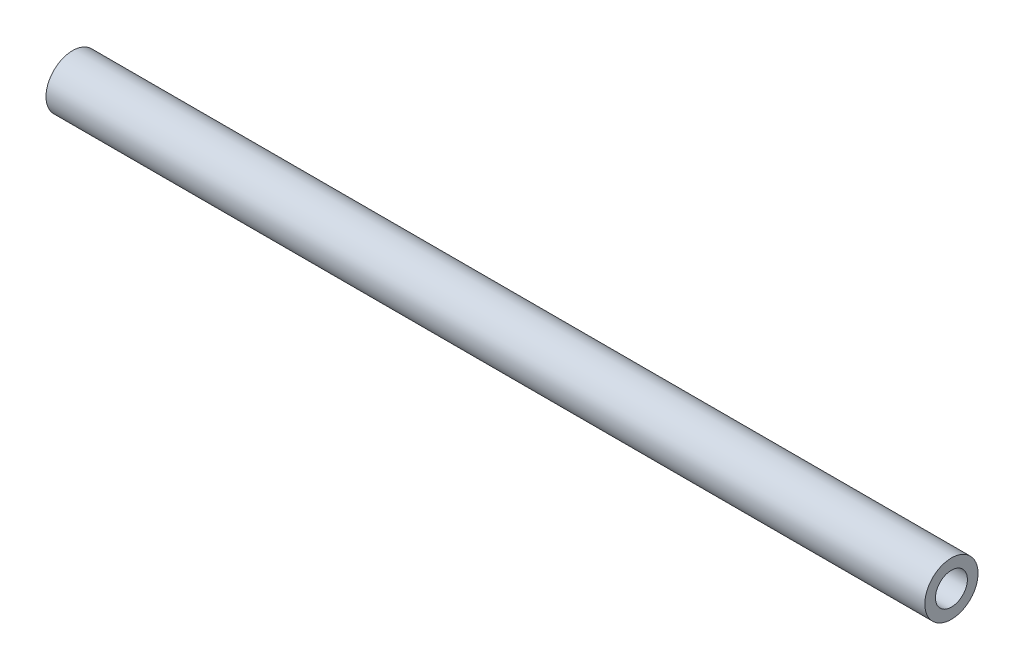
ISO-10303-21;
HEADER;
FILE_DESCRIPTION(('STEP AP214'),'2;1');
FILE_NAME('part.step','',(''),(''),'','','');
FILE_SCHEMA(('AUTOMOTIVE_DESIGN { 1 0 10303 214 1 1 1 1 }'));
ENDSEC;
DATA;
#1=APPLICATION_CONTEXT('core data for automotive mechanical design processes');
#2=APPLICATION_PROTOCOL_DEFINITION('international standard','automotive_design',2000,#1);
#3=PRODUCT_CONTEXT('',#1,'mechanical');
#4=PRODUCT('Part','Part','',(#3));
#5=PRODUCT_RELATED_PRODUCT_CATEGORY('part','',(#4));
#6=PRODUCT_DEFINITION_FORMATION('','',#4);
#7=PRODUCT_DEFINITION_CONTEXT('part definition',#1,'design');
#8=PRODUCT_DEFINITION('design','',#6,#7);
#9=PRODUCT_DEFINITION_SHAPE('','',#8);
#10=(LENGTH_UNIT() NAMED_UNIT(*) SI_UNIT(.MILLI.,.METRE.));
#11=(NAMED_UNIT(*) PLANE_ANGLE_UNIT() SI_UNIT($,.RADIAN.));
#12=(NAMED_UNIT(*) SI_UNIT($,.STERADIAN.) SOLID_ANGLE_UNIT());
#13=UNCERTAINTY_MEASURE_WITH_UNIT(LENGTH_MEASURE(1.E-05),#10,'distance_accuracy_value','');
#14=(GEOMETRIC_REPRESENTATION_CONTEXT(3) GLOBAL_UNCERTAINTY_ASSIGNED_CONTEXT((#13)) GLOBAL_UNIT_ASSIGNED_CONTEXT((#10,
#11,#12)) REPRESENTATION_CONTEXT('',''));
#15=CARTESIAN_POINT('',(0.,0.,0.));
#16=DIRECTION('',(0.,0.,1.));
#17=DIRECTION('',(1.,0.,0.));
#18=AXIS2_PLACEMENT_3D('',#15,#16,#17);
#19=CARTESIAN_POINT('',(165.,0.,0.));
#20=DIRECTION('',(-1.,0.,0.));
#21=DIRECTION('',(0.,0.,1.));
#22=AXIS2_PLACEMENT_3D('',#19,#20,#21);
#23=CYLINDRICAL_SURFACE('',#22,3.);
#24=CARTESIAN_POINT('',(0.,0.,0.));
#25=DIRECTION('',(-1.,0.,0.));
#26=DIRECTION('',(0.,0.,1.));
#27=AXIS2_PLACEMENT_3D('',#24,#25,#26);
#28=CIRCLE('',#27,3.);
#29=CARTESIAN_POINT('',(0.,0.,3.));
#30=VERTEX_POINT('',#29);
#31=EDGE_CURVE('E10',#30,#30,#28,.T.);
#32=ORIENTED_EDGE('',*,*,#31,.T.);
#33=EDGE_LOOP('',(#32));
#34=FACE_BOUND('',#33,.T.);
#35=CARTESIAN_POINT('',(165.,0.,0.));
#36=DIRECTION('',(-1.,0.,0.));
#37=DIRECTION('',(0.,0.,1.));
#38=AXIS2_PLACEMENT_3D('',#35,#36,#37);
#39=CIRCLE('',#38,3.);
#40=CARTESIAN_POINT('',(165.,0.,3.));
#41=VERTEX_POINT('',#40);
#42=EDGE_CURVE('E45',#41,#41,#39,.T.);
#43=ORIENTED_EDGE('',*,*,#42,.F.);
#44=EDGE_LOOP('',(#43));
#45=FACE_BOUND('',#44,.T.);
#46=ADVANCED_FACE('F31',(#34,#45),#23,.F.);
#47=CARTESIAN_POINT('',(0.,3.,0.));
#48=DIRECTION('',(-1.,0.,0.));
#49=DIRECTION('',(0.,0.,1.));
#50=AXIS2_PLACEMENT_3D('',#47,#48,#49);
#51=PLANE('',#50);
#52=CARTESIAN_POINT('',(0.,0.,0.));
#53=DIRECTION('',(-1.,0.,0.));
#54=DIRECTION('',(0.,0.,1.));
#55=AXIS2_PLACEMENT_3D('',#52,#53,#54);
#56=CIRCLE('',#55,5.);
#57=CARTESIAN_POINT('',(0.,0.,5.));
#58=VERTEX_POINT('',#57);
#59=EDGE_CURVE('E37',#58,#58,#56,.T.);
#60=ORIENTED_EDGE('',*,*,#59,.T.);
#61=EDGE_LOOP('',(#60));
#62=FACE_BOUND('',#61,.T.);
#63=ORIENTED_EDGE('',*,*,#31,.F.);
#64=EDGE_LOOP('',(#63));
#65=FACE_BOUND('',#64,.T.);
#66=ADVANCED_FACE('F55',(#62,#65),#51,.T.);
#67=CARTESIAN_POINT('',(165.,0.,0.));
#68=DIRECTION('',(-1.,0.,0.));
#69=DIRECTION('',(0.,0.,1.));
#70=AXIS2_PLACEMENT_3D('',#67,#68,#69);
#71=CYLINDRICAL_SURFACE('',#70,5.);
#72=CARTESIAN_POINT('',(165.,0.,0.));
#73=DIRECTION('',(-1.,0.,0.));
#74=DIRECTION('',(0.,0.,1.));
#75=AXIS2_PLACEMENT_3D('',#72,#73,#74);
#76=CIRCLE('',#75,5.);
#77=CARTESIAN_POINT('',(165.,0.,5.));
#78=VERTEX_POINT('',#77);
#79=EDGE_CURVE('E41',#78,#78,#76,.T.);
#80=ORIENTED_EDGE('',*,*,#79,.T.);
#81=EDGE_LOOP('',(#80));
#82=FACE_BOUND('',#81,.T.);
#83=ORIENTED_EDGE('',*,*,#59,.F.);
#84=EDGE_LOOP('',(#83));
#85=FACE_BOUND('',#84,.T.);
#86=ADVANCED_FACE('F59',(#82,#85),#71,.T.);
#87=CARTESIAN_POINT('',(165.,5.,0.));
#88=DIRECTION('',(1.,0.,0.));
#89=DIRECTION('',(0.,0.,-1.));
#90=AXIS2_PLACEMENT_3D('',#87,#88,#89);
#91=PLANE('',#90);
#92=ORIENTED_EDGE('',*,*,#42,.T.);
#93=EDGE_LOOP('',(#92));
#94=FACE_BOUND('',#93,.T.);
#95=ORIENTED_EDGE('',*,*,#79,.F.);
#96=EDGE_LOOP('',(#95));
#97=FACE_BOUND('',#96,.T.);
#98=ADVANCED_FACE('F51',(#94,#97),#91,.T.);
#99=CLOSED_SHELL('',(#46,#66,#86,#98));
#100=MANIFOLD_SOLID_BREP('B2',#99);
#101=ADVANCED_BREP_SHAPE_REPRESENTATION('',(#18,#100),#14);
#102=SHAPE_DEFINITION_REPRESENTATION(#9,#101);
ENDSEC;
END-ISO-10303-21;
